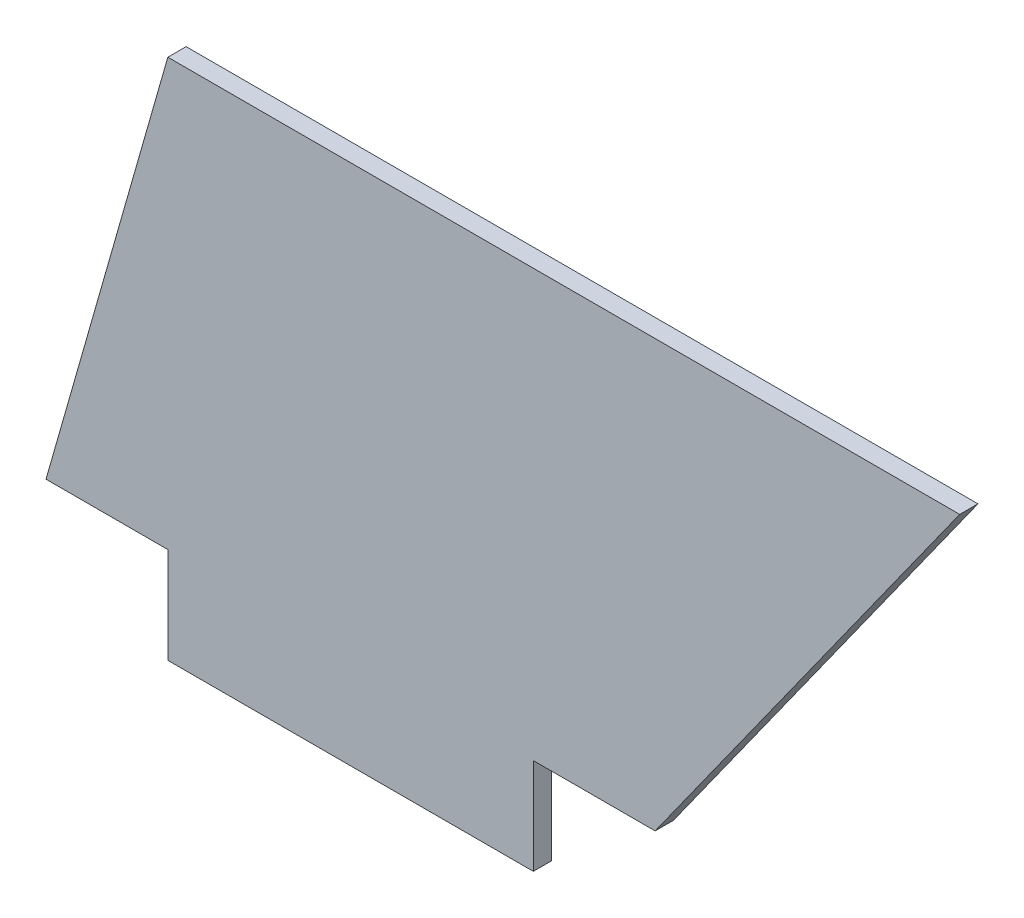
ISO-10303-21;
HEADER;
FILE_DESCRIPTION(('STEP AP214'),'2;1');
FILE_NAME('part.step','',(''),(''),'','','');
FILE_SCHEMA(('AUTOMOTIVE_DESIGN { 1 0 10303 214 1 1 1 1 }'));
ENDSEC;
DATA;
#1=APPLICATION_CONTEXT('core data for automotive mechanical design processes');
#2=APPLICATION_PROTOCOL_DEFINITION('international standard','automotive_design',2000,#1);
#3=PRODUCT_CONTEXT('',#1,'mechanical');
#4=PRODUCT('Part','Part','',(#3));
#5=PRODUCT_RELATED_PRODUCT_CATEGORY('part','',(#4));
#6=PRODUCT_DEFINITION_FORMATION('','',#4);
#7=PRODUCT_DEFINITION_CONTEXT('part definition',#1,'design');
#8=PRODUCT_DEFINITION('design','',#6,#7);
#9=PRODUCT_DEFINITION_SHAPE('','',#8);
#10=(LENGTH_UNIT() NAMED_UNIT(*) SI_UNIT(.MILLI.,.METRE.));
#11=(NAMED_UNIT(*) PLANE_ANGLE_UNIT() SI_UNIT($,.RADIAN.));
#12=(NAMED_UNIT(*) SI_UNIT($,.STERADIAN.) SOLID_ANGLE_UNIT());
#13=UNCERTAINTY_MEASURE_WITH_UNIT(LENGTH_MEASURE(1.E-05),#10,'distance_accuracy_value','');
#14=(GEOMETRIC_REPRESENTATION_CONTEXT(3) GLOBAL_UNCERTAINTY_ASSIGNED_CONTEXT((#13)) GLOBAL_UNIT_ASSIGNED_CONTEXT((#10,
#11,#12)) REPRESENTATION_CONTEXT('',''));
#15=CARTESIAN_POINT('',(0.,0.,0.));
#16=DIRECTION('',(0.,0.,1.));
#17=DIRECTION('',(1.,0.,0.));
#18=AXIS2_PLACEMENT_3D('',#15,#16,#17);
#19=CARTESIAN_POINT('',(9.99999999999999,35.,1.5));
#20=DIRECTION('',(0.961523947640823,-0.274721127897378,0.));
#21=DIRECTION('',(0.274721127897378,0.961523947640823,0.));
#22=AXIS2_PLACEMENT_3D('',#19,#20,#21);
#23=PLANE('',#22);
#24=DIRECTION('',(-0.274721127897378,-0.961523947640823,0.));
#25=VECTOR('',#24,1.);
#26=CARTESIAN_POINT('',(9.99999999999999,35.,0.));
#27=LINE('',#26,#25);
#28=CARTESIAN_POINT('',(9.99999999999999,35.,0.));
#29=VERTEX_POINT('',#28);
#30=CARTESIAN_POINT('',(0.,0.,0.));
#31=VERTEX_POINT('',#30);
#32=EDGE_CURVE('E131',#29,#31,#27,.T.);
#33=ORIENTED_EDGE('',*,*,#32,.T.);
#34=DIRECTION('',(0.,0.,-1.));
#35=VECTOR('',#34,1.);
#36=CARTESIAN_POINT('',(0.,0.,1.5));
#37=LINE('',#36,#35);
#38=CARTESIAN_POINT('',(0.,0.,1.5));
#39=VERTEX_POINT('',#38);
#40=EDGE_CURVE('E11',#39,#31,#37,.T.);
#41=ORIENTED_EDGE('',*,*,#40,.F.);
#42=DIRECTION('',(-0.274721127897378,-0.961523947640823,0.));
#43=VECTOR('',#42,1.);
#44=CARTESIAN_POINT('',(9.99999999999999,35.,1.5));
#45=LINE('',#44,#43);
#46=CARTESIAN_POINT('',(9.99999999999999,35.,1.5));
#47=VERTEX_POINT('',#46);
#48=EDGE_CURVE('E145',#47,#39,#45,.T.);
#49=ORIENTED_EDGE('',*,*,#48,.F.);
#50=DIRECTION('',(0.,0.,-1.));
#51=VECTOR('',#50,1.);
#52=CARTESIAN_POINT('',(9.99999999999999,35.,1.5));
#53=LINE('',#52,#51);
#54=EDGE_CURVE('E127',#47,#29,#53,.T.);
#55=ORIENTED_EDGE('',*,*,#54,.T.);
#56=EDGE_LOOP('',(#33,#41,#49,#55));
#57=FACE_BOUND('',#56,.T.);
#58=ADVANCED_FACE('F35',(#57),#23,.F.);
#59=CARTESIAN_POINT('',(0.,0.,1.5));
#60=DIRECTION('',(0.,1.,0.));
#61=DIRECTION('',(0.,0.,1.));
#62=AXIS2_PLACEMENT_3D('',#59,#60,#61);
#63=PLANE('',#62);
#64=DIRECTION('',(1.,0.,0.));
#65=VECTOR('',#64,1.);
#66=CARTESIAN_POINT('',(0.,0.,0.));
#67=LINE('',#66,#65);
#68=CARTESIAN_POINT('',(10.,0.,0.));
#69=VERTEX_POINT('',#68);
#70=EDGE_CURVE('E134',#31,#69,#67,.T.);
#71=ORIENTED_EDGE('',*,*,#70,.T.);
#72=DIRECTION('',(0.,0.,-1.));
#73=VECTOR('',#72,1.);
#74=CARTESIAN_POINT('',(10.,0.,1.5));
#75=LINE('',#74,#73);
#76=CARTESIAN_POINT('',(10.,0.,1.5));
#77=VERTEX_POINT('',#76);
#78=EDGE_CURVE('E43',#77,#69,#75,.T.);
#79=ORIENTED_EDGE('',*,*,#78,.F.);
#80=DIRECTION('',(1.,0.,0.));
#81=VECTOR('',#80,1.);
#82=CARTESIAN_POINT('',(0.,0.,1.5));
#83=LINE('',#82,#81);
#84=EDGE_CURVE('E94',#39,#77,#83,.T.);
#85=ORIENTED_EDGE('',*,*,#84,.F.);
#86=ORIENTED_EDGE('',*,*,#40,.T.);
#87=EDGE_LOOP('',(#71,#79,#85,#86));
#88=FACE_BOUND('',#87,.T.);
#89=ADVANCED_FACE('F180',(#88),#63,.F.);
#90=CARTESIAN_POINT('',(10.,0.,1.5));
#91=DIRECTION('',(1.,0.,0.));
#92=DIRECTION('',(0.,1.,0.));
#93=AXIS2_PLACEMENT_3D('',#90,#91,#92);
#94=PLANE('',#93);
#95=DIRECTION('',(0.,-1.,0.));
#96=VECTOR('',#95,1.);
#97=CARTESIAN_POINT('',(10.,0.,0.));
#98=LINE('',#97,#96);
#99=CARTESIAN_POINT('',(10.,-7.875,0.));
#100=VERTEX_POINT('',#99);
#101=EDGE_CURVE('E136',#69,#100,#98,.T.);
#102=ORIENTED_EDGE('',*,*,#101,.T.);
#103=DIRECTION('',(0.,0.,-1.));
#104=VECTOR('',#103,1.);
#105=CARTESIAN_POINT('',(10.,-7.875,1.5));
#106=LINE('',#105,#104);
#107=CARTESIAN_POINT('',(10.,-7.875,1.5));
#108=VERTEX_POINT('',#107);
#109=EDGE_CURVE('E152',#108,#100,#106,.T.);
#110=ORIENTED_EDGE('',*,*,#109,.F.);
#111=DIRECTION('',(0.,-1.,0.));
#112=VECTOR('',#111,1.);
#113=CARTESIAN_POINT('',(10.,0.,1.5));
#114=LINE('',#113,#112);
#115=EDGE_CURVE('E160',#77,#108,#114,.T.);
#116=ORIENTED_EDGE('',*,*,#115,.F.);
#117=ORIENTED_EDGE('',*,*,#78,.T.);
#118=EDGE_LOOP('',(#102,#110,#116,#117));
#119=FACE_BOUND('',#118,.T.);
#120=ADVANCED_FACE('F158',(#119),#94,.F.);
#121=CARTESIAN_POINT('',(10.,-7.875,1.5));
#122=DIRECTION('',(0.,1.,0.));
#123=DIRECTION('',(0.,0.,1.));
#124=AXIS2_PLACEMENT_3D('',#121,#122,#123);
#125=PLANE('',#124);
#126=DIRECTION('',(1.,0.,0.));
#127=VECTOR('',#126,1.);
#128=CARTESIAN_POINT('',(10.,-7.875,0.));
#129=LINE('',#128,#127);
#130=CARTESIAN_POINT('',(40.,-7.875,0.));
#131=VERTEX_POINT('',#130);
#132=EDGE_CURVE('E138',#100,#131,#129,.T.);
#133=ORIENTED_EDGE('',*,*,#132,.T.);
#134=DIRECTION('',(0.,0.,-1.));
#135=VECTOR('',#134,1.);
#136=CARTESIAN_POINT('',(40.,-7.875,1.5));
#137=LINE('',#136,#135);
#138=CARTESIAN_POINT('',(40.,-7.875,1.5));
#139=VERTEX_POINT('',#138);
#140=EDGE_CURVE('E149',#139,#131,#137,.T.);
#141=ORIENTED_EDGE('',*,*,#140,.F.);
#142=DIRECTION('',(1.,0.,0.));
#143=VECTOR('',#142,1.);
#144=CARTESIAN_POINT('',(10.,-7.875,1.5));
#145=LINE('',#144,#143);
#146=EDGE_CURVE('E172',#108,#139,#145,.T.);
#147=ORIENTED_EDGE('',*,*,#146,.F.);
#148=ORIENTED_EDGE('',*,*,#109,.T.);
#149=EDGE_LOOP('',(#133,#141,#147,#148));
#150=FACE_BOUND('',#149,.T.);
#151=ADVANCED_FACE('F168',(#150),#125,.F.);
#152=CARTESIAN_POINT('',(40.,-7.875,1.5));
#153=DIRECTION('',(-1.,0.,0.));
#154=DIRECTION('',(0.,0.,1.));
#155=AXIS2_PLACEMENT_3D('',#152,#153,#154);
#156=PLANE('',#155);
#157=DIRECTION('',(0.,1.,0.));
#158=VECTOR('',#157,1.);
#159=CARTESIAN_POINT('',(40.,-7.875,0.));
#160=LINE('',#159,#158);
#161=CARTESIAN_POINT('',(40.,0.,0.));
#162=VERTEX_POINT('',#161);
#163=EDGE_CURVE('E140',#131,#162,#160,.T.);
#164=ORIENTED_EDGE('',*,*,#163,.T.);
#165=DIRECTION('',(0.,0.,-1.));
#166=VECTOR('',#165,1.);
#167=CARTESIAN_POINT('',(40.,0.,1.5));
#168=LINE('',#167,#166);
#169=CARTESIAN_POINT('',(40.,0.,1.5));
#170=VERTEX_POINT('',#169);
#171=EDGE_CURVE('E122',#170,#162,#168,.T.);
#172=ORIENTED_EDGE('',*,*,#171,.F.);
#173=DIRECTION('',(0.,1.,0.));
#174=VECTOR('',#173,1.);
#175=CARTESIAN_POINT('',(40.,-7.875,1.5));
#176=LINE('',#175,#174);
#177=EDGE_CURVE('E113',#139,#170,#176,.T.);
#178=ORIENTED_EDGE('',*,*,#177,.F.);
#179=ORIENTED_EDGE('',*,*,#140,.T.);
#180=EDGE_LOOP('',(#164,#172,#178,#179));
#181=FACE_BOUND('',#180,.T.);
#182=ADVANCED_FACE('F171',(#181),#156,.F.);
#183=CARTESIAN_POINT('',(40.,0.,1.5));
#184=DIRECTION('',(0.,1.,0.));
#185=DIRECTION('',(0.,0.,1.));
#186=AXIS2_PLACEMENT_3D('',#183,#184,#185);
#187=PLANE('',#186);
#188=DIRECTION('',(1.,0.,0.));
#189=VECTOR('',#188,1.);
#190=CARTESIAN_POINT('',(40.,0.,0.));
#191=LINE('',#190,#189);
#192=CARTESIAN_POINT('',(50.,0.,0.));
#193=VERTEX_POINT('',#192);
#194=EDGE_CURVE('E121',#162,#193,#191,.T.);
#195=ORIENTED_EDGE('',*,*,#194,.T.);
#196=DIRECTION('',(0.,0.,-1.));
#197=VECTOR('',#196,1.);
#198=CARTESIAN_POINT('',(50.,0.,1.5));
#199=LINE('',#198,#197);
#200=CARTESIAN_POINT('',(50.,0.,1.5));
#201=VERTEX_POINT('',#200);
#202=EDGE_CURVE('E118',#201,#193,#199,.T.);
#203=ORIENTED_EDGE('',*,*,#202,.F.);
#204=DIRECTION('',(1.,0.,0.));
#205=VECTOR('',#204,1.);
#206=CARTESIAN_POINT('',(40.,0.,1.5));
#207=LINE('',#206,#205);
#208=EDGE_CURVE('E107',#170,#201,#207,.T.);
#209=ORIENTED_EDGE('',*,*,#208,.F.);
#210=ORIENTED_EDGE('',*,*,#171,.T.);
#211=EDGE_LOOP('',(#195,#203,#209,#210));
#212=FACE_BOUND('',#211,.T.);
#213=ADVANCED_FACE('F119',(#212),#187,.F.);
#214=CARTESIAN_POINT('',(50.,0.,1.5));
#215=DIRECTION('',(-0.813733471206735,0.581238193719096,0.));
#216=DIRECTION('',(-0.581238193719096,-0.813733471206735,0.));
#217=AXIS2_PLACEMENT_3D('',#214,#215,#216);
#218=PLANE('',#217);
#219=DIRECTION('',(0.581238193719096,0.813733471206735,0.));
#220=VECTOR('',#219,1.);
#221=CARTESIAN_POINT('',(50.,0.,0.));
#222=LINE('',#221,#220);
#223=CARTESIAN_POINT('',(75.,35.,0.));
#224=VERTEX_POINT('',#223);
#225=EDGE_CURVE('E80',#193,#224,#222,.T.);
#226=ORIENTED_EDGE('',*,*,#225,.T.);
#227=DIRECTION('',(0.,0.,-1.));
#228=VECTOR('',#227,1.);
#229=CARTESIAN_POINT('',(75.,35.,1.5));
#230=LINE('',#229,#228);
#231=CARTESIAN_POINT('',(75.,35.,1.5));
#232=VERTEX_POINT('',#231);
#233=EDGE_CURVE('E123',#232,#224,#230,.T.);
#234=ORIENTED_EDGE('',*,*,#233,.F.);
#235=DIRECTION('',(0.581238193719096,0.813733471206735,0.));
#236=VECTOR('',#235,1.);
#237=CARTESIAN_POINT('',(50.,0.,1.5));
#238=LINE('',#237,#236);
#239=EDGE_CURVE('E111',#201,#232,#238,.T.);
#240=ORIENTED_EDGE('',*,*,#239,.F.);
#241=ORIENTED_EDGE('',*,*,#202,.T.);
#242=EDGE_LOOP('',(#226,#234,#240,#241));
#243=FACE_BOUND('',#242,.T.);
#244=ADVANCED_FACE('F125',(#243),#218,.F.);
#245=CARTESIAN_POINT('',(75.,35.,1.5));
#246=DIRECTION('',(0.,-1.,0.));
#247=DIRECTION('',(1.,0.,0.));
#248=AXIS2_PLACEMENT_3D('',#245,#246,#247);
#249=PLANE('',#248);
#250=DIRECTION('',(-1.,0.,0.));
#251=VECTOR('',#250,1.);
#252=CARTESIAN_POINT('',(75.,35.,0.));
#253=LINE('',#252,#251);
#254=EDGE_CURVE('E86',#224,#29,#253,.T.);
#255=ORIENTED_EDGE('',*,*,#254,.T.);
#256=ORIENTED_EDGE('',*,*,#54,.F.);
#257=DIRECTION('',(-1.,0.,0.));
#258=VECTOR('',#257,1.);
#259=CARTESIAN_POINT('',(75.,35.,1.5));
#260=LINE('',#259,#258);
#261=EDGE_CURVE('E51',#232,#47,#260,.T.);
#262=ORIENTED_EDGE('',*,*,#261,.F.);
#263=ORIENTED_EDGE('',*,*,#233,.T.);
#264=EDGE_LOOP('',(#255,#256,#262,#263));
#265=FACE_BOUND('',#264,.T.);
#266=ADVANCED_FACE('F196',(#265),#249,.F.);
#267=CARTESIAN_POINT('',(0.,0.,1.5));
#268=DIRECTION('',(0.,0.,1.));
#269=DIRECTION('',(1.,0.,0.));
#270=AXIS2_PLACEMENT_3D('',#267,#268,#269);
#271=PLANE('',#270);
#272=ORIENTED_EDGE('',*,*,#48,.T.);
#273=ORIENTED_EDGE('',*,*,#84,.T.);
#274=ORIENTED_EDGE('',*,*,#115,.T.);
#275=ORIENTED_EDGE('',*,*,#146,.T.);
#276=ORIENTED_EDGE('',*,*,#177,.T.);
#277=ORIENTED_EDGE('',*,*,#208,.T.);
#278=ORIENTED_EDGE('',*,*,#239,.T.);
#279=ORIENTED_EDGE('',*,*,#261,.T.);
#280=EDGE_LOOP('',(#272,#273,#274,#275,#276,#277,#278,#279));
#281=FACE_BOUND('',#280,.T.);
#282=ADVANCED_FACE('F109',(#281),#271,.T.);
#283=CARTESIAN_POINT('',(0.,0.,0.));
#284=DIRECTION('',(0.,0.,1.));
#285=DIRECTION('',(1.,0.,0.));
#286=AXIS2_PLACEMENT_3D('',#283,#284,#285);
#287=PLANE('',#286);
#288=ORIENTED_EDGE('',*,*,#32,.F.);
#289=ORIENTED_EDGE('',*,*,#254,.F.);
#290=ORIENTED_EDGE('',*,*,#225,.F.);
#291=ORIENTED_EDGE('',*,*,#194,.F.);
#292=ORIENTED_EDGE('',*,*,#163,.F.);
#293=ORIENTED_EDGE('',*,*,#132,.F.);
#294=ORIENTED_EDGE('',*,*,#101,.F.);
#295=ORIENTED_EDGE('',*,*,#70,.F.);
#296=EDGE_LOOP('',(#288,#289,#290,#291,#292,#293,#294,#295));
#297=FACE_BOUND('',#296,.T.);
#298=ADVANCED_FACE('F164',(#297),#287,.F.);
#299=CLOSED_SHELL('',(#58,#89,#120,#151,#182,#213,#244,#266,#282,#298));
#300=MANIFOLD_SOLID_BREP('B2',#299);
#301=ADVANCED_BREP_SHAPE_REPRESENTATION('',(#18,#300),#14);
#302=SHAPE_DEFINITION_REPRESENTATION(#9,#301);
ENDSEC;
END-ISO-10303-21;
